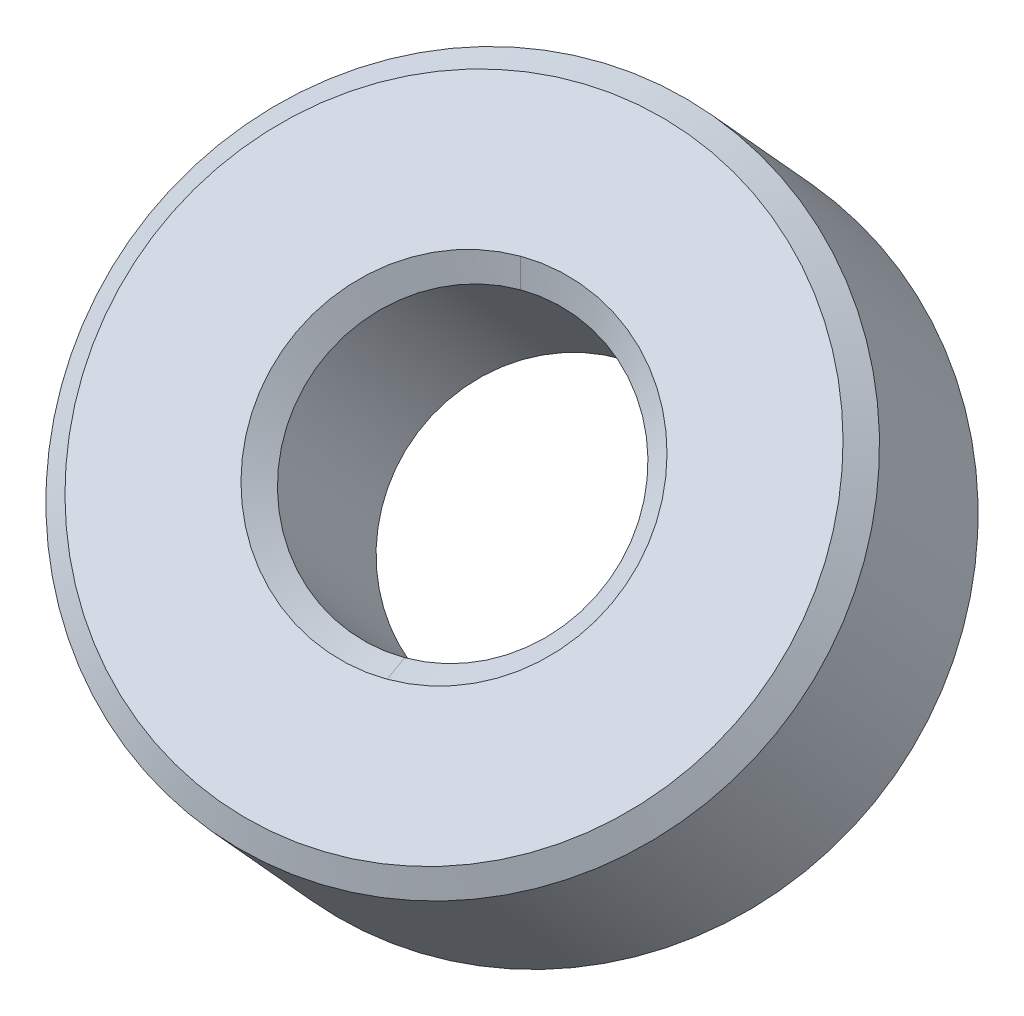
ISO-10303-21;
HEADER;
FILE_DESCRIPTION(('STEP AP214'),'2;1');
FILE_NAME('part.step','',(''),(''),'','','');
FILE_SCHEMA(('AUTOMOTIVE_DESIGN { 1 0 10303 214 1 1 1 1 }'));
ENDSEC;
DATA;
#1=APPLICATION_CONTEXT('core data for automotive mechanical design processes');
#2=APPLICATION_PROTOCOL_DEFINITION('international standard','automotive_design',2000,#1);
#3=PRODUCT_CONTEXT('',#1,'mechanical');
#4=PRODUCT('Part','Part','',(#3));
#5=PRODUCT_RELATED_PRODUCT_CATEGORY('part','',(#4));
#6=PRODUCT_DEFINITION_FORMATION('','',#4);
#7=PRODUCT_DEFINITION_CONTEXT('part definition',#1,'design');
#8=PRODUCT_DEFINITION('design','',#6,#7);
#9=PRODUCT_DEFINITION_SHAPE('','',#8);
#10=(LENGTH_UNIT() NAMED_UNIT(*) SI_UNIT(.MILLI.,.METRE.));
#11=(NAMED_UNIT(*) PLANE_ANGLE_UNIT() SI_UNIT($,.RADIAN.));
#12=(NAMED_UNIT(*) SI_UNIT($,.STERADIAN.) SOLID_ANGLE_UNIT());
#13=UNCERTAINTY_MEASURE_WITH_UNIT(LENGTH_MEASURE(1.E-05),#10,'distance_accuracy_value','');
#14=(GEOMETRIC_REPRESENTATION_CONTEXT(3) GLOBAL_UNCERTAINTY_ASSIGNED_CONTEXT((#13)) GLOBAL_UNIT_ASSIGNED_CONTEXT((#10,
#11,#12)) REPRESENTATION_CONTEXT('',''));
#15=CARTESIAN_POINT('',(0.,0.,0.));
#16=DIRECTION('',(0.,0.,1.));
#17=DIRECTION('',(1.,0.,0.));
#18=AXIS2_PLACEMENT_3D('',#15,#16,#17);
#19=CARTESIAN_POINT('',(-33.15378894075,36.64267132435,26.67002400414));
#20=DIRECTION('',(0.241844762648003,0.707106781186508,0.664463024388707));
#21=DIRECTION('',(0.,-0.684791078771774,0.728739444818647));
#22=AXIS2_PLACEMENT_3D('',#19,#20,#21);
#23=CYLINDRICAL_SURFACE('',#22,2.);
#24=CARTESIAN_POINT('',(-32.2589633189558,39.2589664147308,29.1285371943579));
#25=DIRECTION('',(0.241844762648003,0.707106781186508,0.664463024388707));
#26=DIRECTION('',(-0.970314954424454,0.17624181804585,0.165613135928775));
#27=AXIS2_PLACEMENT_3D('',#24,#25,#26);
#28=CIRCLE('',#27,1.99999999994788);
#29=CARTESIAN_POINT('',(-32.7426528442228,40.6731799770989,27.7996111456149));
#30=VERTEX_POINT('',#29);
#31=CARTESIAN_POINT('',(-31.7752737936773,37.8447528523985,30.4574632429686));
#32=VERTEX_POINT('',#31);
#33=EDGE_CURVE('E47',#30,#32,#28,.T.);
#34=ORIENTED_EDGE('',*,*,#33,.T.);
#35=CARTESIAN_POINT('',(-32.2589633189558,39.2589664147308,29.1285371943579));
#36=DIRECTION('',(0.241844762648003,0.707106781186508,0.664463024388707));
#37=DIRECTION('',(-0.970314954424454,0.17624181804585,0.165613135928775));
#38=AXIS2_PLACEMENT_3D('',#35,#36,#37);
#39=CIRCLE('',#38,1.99999999994788);
#40=EDGE_CURVE('E44',#32,#30,#39,.T.);
#41=ORIENTED_EDGE('',*,*,#40,.T.);
#42=EDGE_LOOP('',(#34,#41));
#43=FACE_BOUND('',#42,.T.);
#44=CARTESIAN_POINT('',(-33.0812355119406,36.8548033587296,26.8693629114819));
#45=DIRECTION('',(-0.241844762648003,-0.707106781186508,-0.664463024388707));
#46=DIRECTION('',(-0.970314954424455,0.176241818068871,0.165613135904274));
#47=AXIS2_PLACEMENT_3D('',#44,#45,#46);
#48=CIRCLE('',#47,1.99999999993971);
#49=CARTESIAN_POINT('',(-35.021865420731,37.2072869948568,27.2005891832805));
#50=VERTEX_POINT('',#49);
#51=EDGE_CURVE('E56',#50,#50,#48,.T.);
#52=ORIENTED_EDGE('',*,*,#51,.T.);
#53=EDGE_LOOP('',(#52));
#54=FACE_BOUND('',#53,.T.);
#55=ADVANCED_FACE('F16',(#43,#54),#23,.F.);
#56=CARTESIAN_POINT('',(-32.1864098901689,39.4710984490648,29.3278761016538));
#57=DIRECTION('',(0.241844762648004,0.707106781186507,0.664463024388707));
#58=DIRECTION('',(0.,-0.684791078771774,0.728739444818647));
#59=AXIS2_PLACEMENT_3D('',#56,#57,#58);
#60=CONICAL_SURFACE('',#59,2.299999999913,0.785398163391203);
#61=ORIENTED_EDGE('',*,*,#40,.F.);
#62=DIRECTION('',(-0.342020143309058,0.,-0.939692620791954));
#63=VECTOR('',#62,1.);
#64=CARTESIAN_POINT('',(273180.763549636,37.844752925405,750675.738633773));
#65=LINE('',#64,#63);
#66=CARTESIAN_POINT('',(-31.6301669360486,37.844752852438,30.856141057748));
#67=VERTEX_POINT('',#66);
#68=EDGE_CURVE('E32',#32,#67,#65,.F.);
#69=ORIENTED_EDGE('',*,*,#68,.T.);
#70=CARTESIAN_POINT('',(-32.1864098901487,39.4710984491238,29.3278761017093));
#71=DIRECTION('',(0.241844762648004,0.707106781186507,0.664463024388707));
#72=DIRECTION('',(0.,-0.684791078771774,0.728739444818647));
#73=AXIS2_PLACEMENT_3D('',#70,#71,#72);
#74=CIRCLE('',#73,2.29999999999647);
#75=CARTESIAN_POINT('',(-32.7426528442146,41.0974440457206,27.7996111456277));
#76=VERTEX_POINT('',#75);
#77=EDGE_CURVE('E19',#76,#67,#74,.F.);
#78=ORIENTED_EDGE('',*,*,#77,.F.);
#79=DIRECTION('',(-1.92802440679429E-11,-1.,6.8005046038877E-12));
#80=VECTOR('',#79,1.);
#81=CARTESIAN_POINT('',(-32.7426374427463,798860.696410446,27.7996057132584));
#82=LINE('',#81,#80);
#83=EDGE_CURVE('E48',#76,#30,#82,.T.);
#84=ORIENTED_EDGE('',*,*,#83,.T.);
#85=EDGE_LOOP('',(#61,#69,#78,#84));
#86=FACE_BOUND('',#85,.T.);
#87=ADVANCED_FACE('F50',(#86),#60,.F.);
#88=CARTESIAN_POINT('',(-32.1864098901689,39.4710984490648,29.3278761016538));
#89=DIRECTION('',(0.241844762648004,0.707106781186507,0.664463024388707));
#90=DIRECTION('',(0.,-0.684791078771774,0.728739444818647));
#91=AXIS2_PLACEMENT_3D('',#88,#89,#90);
#92=CONICAL_SURFACE('',#91,2.299999999913,0.785398163408494);
#93=ORIENTED_EDGE('',*,*,#33,.F.);
#94=ORIENTED_EDGE('',*,*,#83,.F.);
#95=CARTESIAN_POINT('',(-32.1864098901573,39.4710984490989,29.3278761016859));
#96=DIRECTION('',(0.241844762648004,0.707106781186507,0.664463024388707));
#97=DIRECTION('',(0.,-0.684791078771774,0.728739444818647));
#98=AXIS2_PLACEMENT_3D('',#95,#96,#97);
#99=CIRCLE('',#98,2.29999999996125);
#100=EDGE_CURVE('E71',#67,#76,#99,.F.);
#101=ORIENTED_EDGE('',*,*,#100,.F.);
#102=ORIENTED_EDGE('',*,*,#68,.F.);
#103=EDGE_LOOP('',(#93,#94,#101,#102));
#104=FACE_BOUND('',#103,.T.);
#105=ADVANCED_FACE('F54',(#104),#92,.F.);
#106=CARTESIAN_POINT('',(-33.1537889407482,36.6426713243351,26.670024004129));
#107=DIRECTION('',(-0.241844762648001,-0.707106781186509,-0.664463024388707));
#108=DIRECTION('',(0.,0.684791078771773,-0.728739444818648));
#109=AXIS2_PLACEMENT_3D('',#106,#107,#108);
#110=CONICAL_SURFACE('',#109,2.30000000001481,0.785398163377553);
#111=ORIENTED_EDGE('',*,*,#51,.F.);
#112=EDGE_LOOP('',(#111));
#113=FACE_BOUND('',#112,.T.);
#114=CARTESIAN_POINT('',(-33.1537889407607,36.6426713242987,26.6700240040949));
#115=DIRECTION('',(-0.241844762648001,-0.707106781186509,-0.664463024388707));
#116=DIRECTION('',(0.,0.684791078771773,-0.728739444818648));
#117=AXIS2_PLACEMENT_3D('',#114,#115,#116);
#118=CIRCLE('',#117,2.30000000006619);
#119=CARTESIAN_POINT('',(-33.1537889407607,38.2176908055191,24.9939232809638));
#120=VERTEX_POINT('',#119);
#121=EDGE_CURVE('E69',#120,#120,#118,.T.);
#122=ORIENTED_EDGE('',*,*,#121,.T.);
#123=EDGE_LOOP('',(#122));
#124=FACE_BOUND('',#123,.T.);
#125=ADVANCED_FACE('F97',(#113,#124),#110,.F.);
#126=CARTESIAN_POINT('',(-32.18640989015,39.4710984491,29.32787610169));
#127=DIRECTION('',(0.241844762648003,0.707106781186508,0.664463024388707));
#128=DIRECTION('',(0.,-0.684791078771774,0.728739444818647));
#129=AXIS2_PLACEMENT_3D('',#126,#127,#128);
#130=PLANE('',#129);
#131=ORIENTED_EDGE('',*,*,#77,.T.);
#132=ORIENTED_EDGE('',*,*,#100,.T.);
#133=EDGE_LOOP('',(#131,#132));
#134=FACE_BOUND('',#133,.T.);
#135=CARTESIAN_POINT('',(-32.1864098901508,39.4710984491046,29.3278761016964));
#136=DIRECTION('',(-0.241844762648002,-0.707106781186508,-0.664463024388707));
#137=DIRECTION('',(0.,0.684791078771774,-0.728739444818647));
#138=AXIS2_PLACEMENT_3D('',#135,#136,#137);
#139=CIRCLE('',#138,4.20000000004533);
#140=CARTESIAN_POINT('',(-32.1864098901508,42.3472209799771,26.267170433425));
#141=VERTEX_POINT('',#140);
#142=EDGE_CURVE('E66',#141,#141,#139,.T.);
#143=ORIENTED_EDGE('',*,*,#142,.F.);
#144=EDGE_LOOP('',(#143));
#145=FACE_BOUND('',#144,.T.);
#146=ADVANCED_FACE('F95',(#134,#145),#130,.T.);
#147=CARTESIAN_POINT('',(-33.15378894075,36.64267132435,26.67002400414));
#148=DIRECTION('',(0.241844762648003,0.707106781186508,0.664463024388707));
#149=DIRECTION('',(0.,-0.684791078771774,0.728739444818647));
#150=AXIS2_PLACEMENT_3D('',#147,#148,#149);
#151=PLANE('',#150);
#152=ORIENTED_EDGE('',*,*,#121,.F.);
#153=EDGE_LOOP('',(#152));
#154=FACE_BOUND('',#153,.T.);
#155=CARTESIAN_POINT('',(-33.1537889407233,36.642671324421,26.6700240042047));
#156=DIRECTION('',(0.241844762648003,0.707106781186508,0.664463024388707));
#157=DIRECTION('',(0.,-0.684791078771774,0.728739444818647));
#158=AXIS2_PLACEMENT_3D('',#155,#156,#157);
#159=CIRCLE('',#158,4.20000000005015);
#160=CARTESIAN_POINT('',(-33.1537889407233,33.7665487935452,29.7307296724796));
#161=VERTEX_POINT('',#160);
#162=EDGE_CURVE('E63',#161,#161,#159,.T.);
#163=ORIENTED_EDGE('',*,*,#162,.F.);
#164=EDGE_LOOP('',(#163));
#165=FACE_BOUND('',#164,.T.);
#166=ADVANCED_FACE('F91',(#154,#165),#151,.F.);
#167=CARTESIAN_POINT('',(-32.2589633189652,39.2589664146902,29.1285371943248));
#168=DIRECTION('',(-0.241844762648002,-0.707106781186508,-0.664463024388707));
#169=DIRECTION('',(0.,0.684791078771774,-0.728739444818647));
#170=AXIS2_PLACEMENT_3D('',#167,#168,#169);
#171=CONICAL_SURFACE('',#170,4.50000000012654,0.785398163395102);
#172=CARTESIAN_POINT('',(-32.2589633189517,39.2589664147419,29.12853719438));
#173=DIRECTION('',(0.241844762648003,0.707106781186508,0.664463024388707));
#174=DIRECTION('',(0.,-0.684791078771774,0.728739444818647));
#175=AXIS2_PLACEMENT_3D('',#172,#173,#174);
#176=CIRCLE('',#175,4.5);
#177=CARTESIAN_POINT('',(-32.2589633189517,36.1774065602689,32.4078646960639));
#178=VERTEX_POINT('',#177);
#179=EDGE_CURVE('E24',#178,#178,#176,.F.);
#180=ORIENTED_EDGE('',*,*,#179,.F.);
#181=EDGE_LOOP('',(#180));
#182=FACE_BOUND('',#181,.T.);
#183=ORIENTED_EDGE('',*,*,#142,.T.);
#184=EDGE_LOOP('',(#183));
#185=FACE_BOUND('',#184,.T.);
#186=ADVANCED_FACE('F87',(#182,#185),#171,.T.);
#187=CARTESIAN_POINT('',(-33.0812355119213,36.8548033587994,26.8693629115424));
#188=DIRECTION('',(0.241844762648003,0.707106781186508,0.664463024388707));
#189=DIRECTION('',(0.,-0.684791078771774,0.728739444818647));
#190=AXIS2_PLACEMENT_3D('',#187,#188,#189);
#191=CONICAL_SURFACE('',#190,4.50000000008943,0.785398163410055);
#192=CARTESIAN_POINT('',(-33.0812355119559,36.8548033587052,26.8693629114559));
#193=DIRECTION('',(0.241844762648003,0.707106781186508,0.664463024388707));
#194=DIRECTION('',(0.,-0.684791078771774,0.728739444818647));
#195=AXIS2_PLACEMENT_3D('',#192,#193,#194);
#196=CIRCLE('',#195,4.5);
#197=CARTESIAN_POINT('',(-33.0812355119559,33.7732435042322,30.1486904131398));
#198=VERTEX_POINT('',#197);
#199=EDGE_CURVE('E11',#198,#198,#196,.T.);
#200=ORIENTED_EDGE('',*,*,#199,.F.);
#201=EDGE_LOOP('',(#200));
#202=FACE_BOUND('',#201,.T.);
#203=ORIENTED_EDGE('',*,*,#162,.T.);
#204=EDGE_LOOP('',(#203));
#205=FACE_BOUND('',#204,.T.);
#206=ADVANCED_FACE('F90',(#202,#205),#191,.T.);
#207=CARTESIAN_POINT('',(-33.15378894075,36.64267132435,26.67002400414));
#208=DIRECTION('',(0.241844762648003,0.707106781186508,0.664463024388707));
#209=DIRECTION('',(0.,-0.684791078771774,0.728739444818647));
#210=AXIS2_PLACEMENT_3D('',#207,#208,#209);
#211=CYLINDRICAL_SURFACE('',#210,4.5);
#212=ORIENTED_EDGE('',*,*,#179,.T.);
#213=EDGE_LOOP('',(#212));
#214=FACE_BOUND('',#213,.T.);
#215=ORIENTED_EDGE('',*,*,#199,.T.);
#216=EDGE_LOOP('',(#215));
#217=FACE_BOUND('',#216,.T.);
#218=ADVANCED_FACE('F84',(#214,#217),#211,.T.);
#219=CLOSED_SHELL('',(#55,#87,#105,#125,#146,#166,#186,#206,#218));
#220=MANIFOLD_SOLID_BREP('B1',#219);
#221=ADVANCED_BREP_SHAPE_REPRESENTATION('',(#18,#220),#14);
#222=SHAPE_DEFINITION_REPRESENTATION(#9,#221);
ENDSEC;
END-ISO-10303-21;
